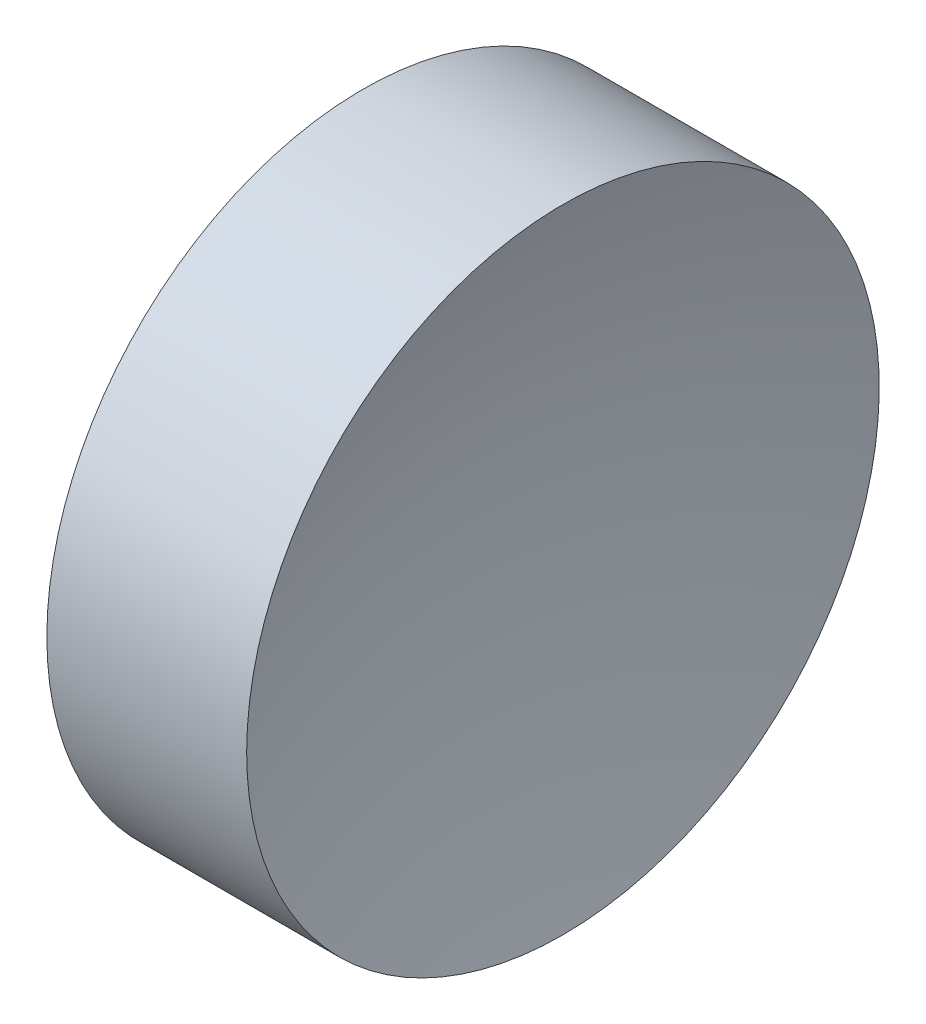
ISO-10303-21;
HEADER;
FILE_DESCRIPTION(('STEP AP214'),'2;1');
FILE_NAME('part.step','',(''),(''),'','','');
FILE_SCHEMA(('AUTOMOTIVE_DESIGN { 1 0 10303 214 1 1 1 1 }'));
ENDSEC;
DATA;
#1=APPLICATION_CONTEXT('core data for automotive mechanical design processes');
#2=APPLICATION_PROTOCOL_DEFINITION('international standard','automotive_design',2000,#1);
#3=PRODUCT_CONTEXT('',#1,'mechanical');
#4=PRODUCT('Part','Part','',(#3));
#5=PRODUCT_RELATED_PRODUCT_CATEGORY('part','',(#4));
#6=PRODUCT_DEFINITION_FORMATION('','',#4);
#7=PRODUCT_DEFINITION_CONTEXT('part definition',#1,'design');
#8=PRODUCT_DEFINITION('design','',#6,#7);
#9=PRODUCT_DEFINITION_SHAPE('','',#8);
#10=(LENGTH_UNIT() NAMED_UNIT(*) SI_UNIT(.MILLI.,.METRE.));
#11=(NAMED_UNIT(*) PLANE_ANGLE_UNIT() SI_UNIT($,.RADIAN.));
#12=(NAMED_UNIT(*) SI_UNIT($,.STERADIAN.) SOLID_ANGLE_UNIT());
#13=UNCERTAINTY_MEASURE_WITH_UNIT(LENGTH_MEASURE(1.E-05),#10,'distance_accuracy_value','');
#14=(GEOMETRIC_REPRESENTATION_CONTEXT(3) GLOBAL_UNCERTAINTY_ASSIGNED_CONTEXT((#13)) GLOBAL_UNIT_ASSIGNED_CONTEXT((#10,
#11,#12)) REPRESENTATION_CONTEXT('',''));
#15=CARTESIAN_POINT('',(0.,0.,0.));
#16=DIRECTION('',(0.,0.,1.));
#17=DIRECTION('',(1.,0.,0.));
#18=AXIS2_PLACEMENT_3D('',#15,#16,#17);
#19=CARTESIAN_POINT('',(34.0421894752023,13.0445205745975,0.));
#20=DIRECTION('',(-1.,0.,0.));
#21=DIRECTION('',(0.,-1.,0.));
#22=AXIS2_PLACEMENT_3D('',#19,#20,#21);
#23=SPHERICAL_SURFACE('',#22,10.37);
#24=CARTESIAN_POINT('',(24.1621894752023,13.0445205745975,0.));
#25=DIRECTION('',(-1.,0.,0.));
#26=DIRECTION('',(0.,0.,1.));
#27=AXIS2_PLACEMENT_3D('',#24,#25,#26);
#28=CIRCLE('',#27,3.15);
#29=CARTESIAN_POINT('',(24.1621894752023,13.0445205745975,3.15));
#30=VERTEX_POINT('',#29);
#31=EDGE_CURVE('E10',#30,#30,#28,.T.);
#32=ORIENTED_EDGE('',*,*,#31,.F.);
#33=EDGE_LOOP('',(#32));
#34=FACE_BOUND('',#33,.T.);
#35=ADVANCED_FACE('F35',(#34),#23,.F.);
#36=CARTESIAN_POINT('',(21.2249305570684,13.0445205745975,0.));
#37=DIRECTION('',(-1.,0.,0.));
#38=DIRECTION('',(0.,0.,1.));
#39=AXIS2_PLACEMENT_3D('',#36,#37,#38);
#40=CYLINDRICAL_SURFACE('',#39,3.15);
#41=CARTESIAN_POINT('',(22.1721894752023,13.0445205745975,0.));
#42=DIRECTION('',(-1.,0.,0.));
#43=DIRECTION('',(0.,0.,1.));
#44=AXIS2_PLACEMENT_3D('',#41,#42,#43);
#45=CIRCLE('',#44,3.15);
#46=CARTESIAN_POINT('',(22.1721894752023,13.0445205745975,3.15));
#47=VERTEX_POINT('',#46);
#48=EDGE_CURVE('E41',#47,#47,#45,.T.);
#49=ORIENTED_EDGE('',*,*,#48,.F.);
#50=EDGE_LOOP('',(#49));
#51=FACE_BOUND('',#50,.T.);
#52=ORIENTED_EDGE('',*,*,#31,.T.);
#53=EDGE_LOOP('',(#52));
#54=FACE_BOUND('',#53,.T.);
#55=ADVANCED_FACE('F49',(#51,#54),#40,.T.);
#56=CARTESIAN_POINT('',(22.1721894752023,13.0445205745975,0.));
#57=DIRECTION('',(1.,0.,0.));
#58=DIRECTION('',(0.,0.,-1.));
#59=AXIS2_PLACEMENT_3D('',#56,#57,#58);
#60=PLANE('',#59);
#61=ORIENTED_EDGE('',*,*,#48,.T.);
#62=EDGE_LOOP('',(#61));
#63=FACE_BOUND('',#62,.T.);
#64=ADVANCED_FACE('F47',(#63),#60,.F.);
#65=CLOSED_SHELL('',(#35,#55,#64));
#66=MANIFOLD_SOLID_BREP('B2',#65);
#67=ADVANCED_BREP_SHAPE_REPRESENTATION('',(#18,#66),#14);
#68=SHAPE_DEFINITION_REPRESENTATION(#9,#67);
ENDSEC;
END-ISO-10303-21;
